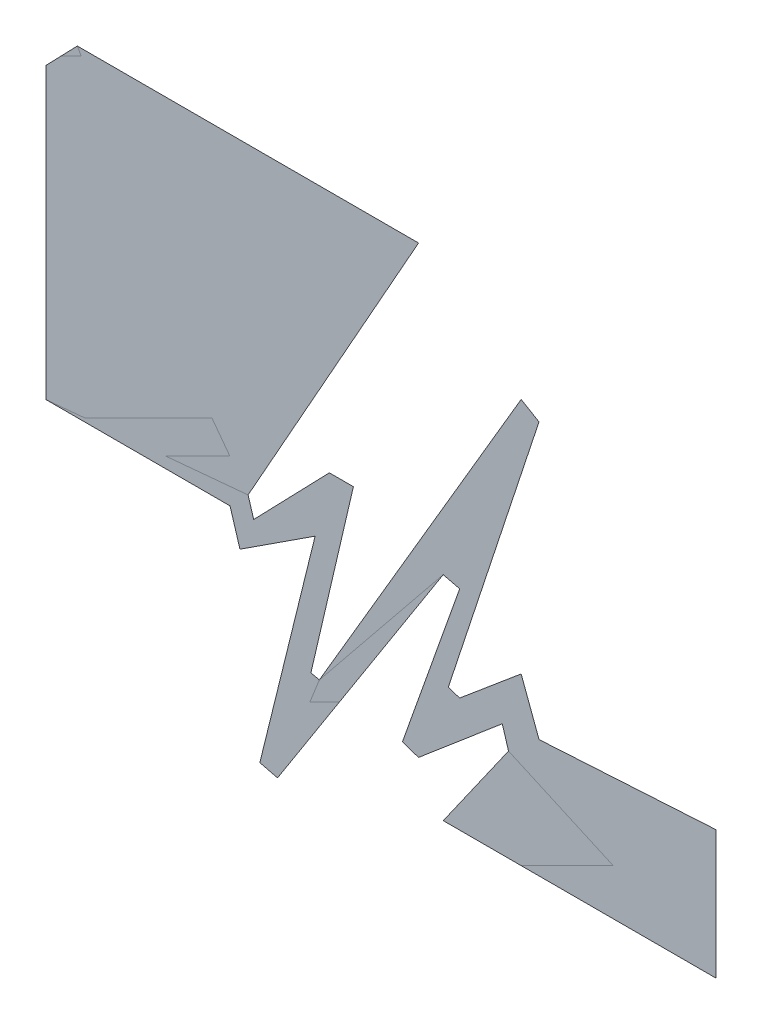
ISO-10303-21;
HEADER;
FILE_DESCRIPTION(('STEP AP214'),'2;1');
FILE_NAME('part.step','',(''),(''),'','','');
FILE_SCHEMA(('AUTOMOTIVE_DESIGN { 1 0 10303 214 1 1 1 1 }'));
ENDSEC;
DATA;
#1=APPLICATION_CONTEXT('core data for automotive mechanical design processes');
#2=APPLICATION_PROTOCOL_DEFINITION('international standard','automotive_design',2000,#1);
#3=PRODUCT_CONTEXT('',#1,'mechanical');
#4=PRODUCT('Part','Part','',(#3));
#5=PRODUCT_RELATED_PRODUCT_CATEGORY('part','',(#4));
#6=PRODUCT_DEFINITION_FORMATION('','',#4);
#7=PRODUCT_DEFINITION_CONTEXT('part definition',#1,'design');
#8=PRODUCT_DEFINITION('design','',#6,#7);
#9=PRODUCT_DEFINITION_SHAPE('','',#8);
#10=(LENGTH_UNIT() NAMED_UNIT(*) SI_UNIT(.MILLI.,.METRE.));
#11=(NAMED_UNIT(*) PLANE_ANGLE_UNIT() SI_UNIT($,.RADIAN.));
#12=(NAMED_UNIT(*) SI_UNIT($,.STERADIAN.) SOLID_ANGLE_UNIT());
#13=UNCERTAINTY_MEASURE_WITH_UNIT(LENGTH_MEASURE(1.E-05),#10,'distance_accuracy_value','');
#14=(GEOMETRIC_REPRESENTATION_CONTEXT(3) GLOBAL_UNCERTAINTY_ASSIGNED_CONTEXT((#13)) GLOBAL_UNIT_ASSIGNED_CONTEXT((#10,
#11,#12)) REPRESENTATION_CONTEXT('',''));
#15=CARTESIAN_POINT('',(0.,0.,0.));
#16=DIRECTION('',(0.,0.,1.));
#17=DIRECTION('',(1.,0.,0.));
#18=AXIS2_PLACEMENT_3D('',#15,#16,#17);
#19=CARTESIAN_POINT('',(5.67705033471,0.853286179995,0.001668));
#20=DIRECTION('',(0.,0.,1.));
#21=DIRECTION('',(1.,0.,0.));
#22=AXIS2_PLACEMENT_3D('',#19,#20,#21);
#23=PLANE('',#22);
#24=CARTESIAN_POINT('',(5.615034054317,0.836498869899,0.001668));
#25=DIRECTION('',(-0.290930916078401,0.956744062991656,0.));
#26=VECTOR('',#25,1.);
#27=LINE('',#24,#26);
#28=CARTESIAN_POINT('',(5.615034054317,0.836498869899,0.0015));
#29=VERTEX_POINT('',#28);
#30=CARTESIAN_POINT('',(5.612052020967,0.846305468461,0.0015));
#31=VERTEX_POINT('',#30);
#32=EDGE_CURVE('E380',#29,#31,#27,.T.);
#33=ORIENTED_EDGE('',*,*,#32,.T.);
#34=CARTESIAN_POINT('',(5.612052020967,0.846305468461,0.001668));
#35=DIRECTION('',(0.489822399636759,0.871822239228897,0.));
#36=VECTOR('',#35,1.);
#37=LINE('',#34,#36);
#38=CARTESIAN_POINT('',(5.702564550781,1.00740638275,0.0015));
#39=VERTEX_POINT('',#38);
#40=EDGE_CURVE('E28',#31,#39,#37,.T.);
#41=ORIENTED_EDGE('',*,*,#40,.T.);
#42=CARTESIAN_POINT('',(5.702564550781,1.00740638275,0.001668));
#43=DIRECTION('',(-1.,0.,0.));
#44=VECTOR('',#43,1.);
#45=LINE('',#42,#44);
#46=CARTESIAN_POINT('',(5.52140258316,1.00740638275,0.0015));
#47=VERTEX_POINT('',#46);
#48=EDGE_CURVE('E11',#39,#47,#45,.T.);
#49=ORIENTED_EDGE('',*,*,#48,.T.);
#50=CARTESIAN_POINT('',(5.52140258316,1.00740638275,0.001668));
#51=DIRECTION('',(-0.695022104774352,-0.718988368386464,0.));
#52=VECTOR('',#51,1.);
#53=LINE('',#50,#52);
#54=CARTESIAN_POINT('',(5.50488152322,0.990315631465,0.0015));
#55=VERTEX_POINT('',#54);
#56=EDGE_CURVE('E122',#47,#55,#53,.T.);
#57=ORIENTED_EDGE('',*,*,#56,.T.);
#58=CARTESIAN_POINT('',(5.50488152322,0.990315631465,0.001668));
#59=DIRECTION('',(0.,-1.,0.));
#60=VECTOR('',#59,1.);
#61=LINE('',#58,#60);
#62=CARTESIAN_POINT('',(5.50488152322,0.836476042626,0.0015));
#63=VERTEX_POINT('',#62);
#64=EDGE_CURVE('E119',#55,#63,#61,.T.);
#65=ORIENTED_EDGE('',*,*,#64,.T.);
#66=CARTESIAN_POINT('',(5.50488152322,0.836476042626,0.001668));
#67=DIRECTION('',(1.,0.,0.));
#68=VECTOR('',#67,1.);
#69=LINE('',#66,#68);
#70=CARTESIAN_POINT('',(5.602478863626,0.836476042626,0.0015));
#71=VERTEX_POINT('',#70);
#72=EDGE_CURVE('E332',#63,#71,#69,.T.);
#73=ORIENTED_EDGE('',*,*,#72,.T.);
#74=CARTESIAN_POINT('',(5.602478863626,0.836476042626,0.001668));
#75=DIRECTION('',(0.290930916059255,-0.956744062997478,0.));
#76=VECTOR('',#75,1.);
#77=LINE('',#74,#76);
#78=CARTESIAN_POINT('',(5.607736954309,0.819184490694,0.0015));
#79=VERTEX_POINT('',#78);
#80=EDGE_CURVE('E333',#71,#79,#77,.T.);
#81=ORIENTED_EDGE('',*,*,#80,.T.);
#82=CARTESIAN_POINT('',(5.607736954309,0.819184490694,0.001668));
#83=DIRECTION('',(0.838198711165695,0.545364942584475,0.));
#84=VECTOR('',#83,1.);
#85=LINE('',#82,#84);
#86=CARTESIAN_POINT('',(5.647645273507,0.845150407747,0.0015));
#87=VERTEX_POINT('',#86);
#88=EDGE_CURVE('E334',#79,#87,#85,.T.);
#89=ORIENTED_EDGE('',*,*,#88,.T.);
#90=CARTESIAN_POINT('',(5.647645273507,0.845150407747,0.001668));
#91=DIRECTION('',(-0.239796451069602,-0.970823187843401,0.));
#92=VECTOR('',#91,1.);
#93=LINE('',#90,#92);
#94=CARTESIAN_POINT('',(5.618296386099,0.726330549046,0.0015));
#95=VERTEX_POINT('',#94);
#96=EDGE_CURVE('E336',#87,#95,#93,.T.);
#97=ORIENTED_EDGE('',*,*,#96,.T.);
#98=CARTESIAN_POINT('',(5.618296386099,0.726330549046,0.001668));
#99=DIRECTION('',(0.970823187839331,-0.239796451086082,0.));
#100=VECTOR('',#99,1.);
#101=LINE('',#98,#100);
#102=CARTESIAN_POINT('',(5.627691113908,0.724010021049,0.0015));
#103=VERTEX_POINT('',#102);
#104=EDGE_CURVE('E338',#95,#103,#101,.T.);
#105=ORIENTED_EDGE('',*,*,#104,.T.);
#106=CARTESIAN_POINT('',(5.627691113908,0.724010021049,0.001668));
#107=DIRECTION('',(0.539142597155286,0.842214497579241,0.));
#108=VECTOR('',#107,1.);
#109=LINE('',#106,#108);
#110=CARTESIAN_POINT('',(5.715674286682,0.861451774018,0.0015));
#111=VERTEX_POINT('',#110);
#112=EDGE_CURVE('E340',#103,#111,#109,.T.);
#113=ORIENTED_EDGE('',*,*,#112,.T.);
#114=CARTESIAN_POINT('',(5.715674286682,0.861451774018,0.001668));
#115=DIRECTION('',(0.970823187840077,-0.239796451083061,0.));
#116=VECTOR('',#115,1.);
#117=LINE('',#114,#116);
#118=CARTESIAN_POINT('',(5.724388688483,0.859299288734,0.0015));
#119=VERTEX_POINT('',#118);
#120=EDGE_CURVE('E342',#111,#119,#117,.T.);
#121=ORIENTED_EDGE('',*,*,#120,.T.);
#122=CARTESIAN_POINT('',(5.724388688483,0.859299288734,0.001668));
#123=DIRECTION('',(-0.334719100787859,-0.942317952480885,0.));
#124=VECTOR('',#123,1.);
#125=LINE('',#122,#124);
#126=CARTESIAN_POINT('',(5.69403629714,0.773849718644,0.0015));
#127=VERTEX_POINT('',#126);
#128=EDGE_CURVE('E344',#119,#127,#125,.T.);
#129=ORIENTED_EDGE('',*,*,#128,.T.);
#130=CARTESIAN_POINT('',(5.69403629714,0.773849718644,0.001668));
#131=DIRECTION('',(0.942317952505512,-0.334719100718526,0.));
#132=VECTOR('',#131,1.);
#133=LINE('',#130,#132);
#134=CARTESIAN_POINT('',(5.702536575865,0.770830349605,0.0015));
#135=VERTEX_POINT('',#134);
#136=EDGE_CURVE('E346',#127,#135,#133,.T.);
#137=ORIENTED_EDGE('',*,*,#136,.T.);
#138=CARTESIAN_POINT('',(5.702536575865,0.770830349605,0.001668));
#139=DIRECTION('',(0.762630156360435,0.646834789269762,0.));
#140=VECTOR('',#139,1.);
#141=LINE('',#138,#140);
#142=CARTESIAN_POINT('',(5.747028371056,0.808566650388,0.0015));
#143=VERTEX_POINT('',#142);
#144=EDGE_CURVE('E348',#135,#143,#141,.T.);
#145=ORIENTED_EDGE('',*,*,#144,.T.);
#146=CARTESIAN_POINT('',(5.747028371056,0.808566650388,0.001668));
#147=DIRECTION('',(0.290930916064505,-0.956744062995882,0.));
#148=VECTOR('',#147,1.);
#149=LINE('',#146,#148);
#150=CARTESIAN_POINT('',(5.750336696642,0.797687019905,0.0015));
#151=VERTEX_POINT('',#150);
#152=EDGE_CURVE('E350',#143,#151,#149,.T.);
#153=ORIENTED_EDGE('',*,*,#152,.T.);
#154=CARTESIAN_POINT('',(5.750336696642,0.797687019905,0.001668));
#155=DIRECTION('',(-0.574791348396888,-0.818300009659102,0.));
#156=VECTOR('',#155,1.);
#157=LINE('',#154,#156);
#158=CARTESIAN_POINT('',(5.715674286682,0.74833998209,0.0015));
#159=VERTEX_POINT('',#158);
#160=EDGE_CURVE('E352',#151,#159,#157,.T.);
#161=ORIENTED_EDGE('',*,*,#160,.T.);
#162=CARTESIAN_POINT('',(5.715674286682,0.74833998209,0.001668));
#163=DIRECTION('',(1.,0.,0.));
#164=VECTOR('',#163,1.);
#165=LINE('',#162,#164);
#166=CARTESIAN_POINT('',(5.860369157796,0.74833998209,0.0015));
#167=VERTEX_POINT('',#166);
#168=EDGE_CURVE('E354',#159,#167,#165,.T.);
#169=ORIENTED_EDGE('',*,*,#168,.T.);
#170=CARTESIAN_POINT('',(5.860369157796,0.74833998209,0.001668));
#171=DIRECTION('',(0.,1.,0.));
#172=VECTOR('',#171,1.);
#173=LINE('',#170,#172);
#174=CARTESIAN_POINT('',(5.860369157796,0.816597330962,0.0015));
#175=VERTEX_POINT('',#174);
#176=EDGE_CURVE('E356',#167,#175,#173,.T.);
#177=ORIENTED_EDGE('',*,*,#176,.T.);
#178=CARTESIAN_POINT('',(5.860369157796,0.816597330962,0.001668));
#179=DIRECTION('',(-0.998267385092081,-0.05884069902218,0.));
#180=VECTOR('',#179,1.);
#181=LINE('',#178,#180);
#182=CARTESIAN_POINT('',(5.766520391411,0.81106561962,0.0015));
#183=VERTEX_POINT('',#182);
#184=EDGE_CURVE('E358',#175,#183,#181,.T.);
#185=ORIENTED_EDGE('',*,*,#184,.T.);
#186=CARTESIAN_POINT('',(5.766520391411,0.81106561962,0.001668));
#187=DIRECTION('',(-0.349274513711859,0.937020444852376,0.));
#188=VECTOR('',#187,1.);
#189=LINE('',#186,#188);
#190=CARTESIAN_POINT('',(5.757040143491,0.836498869899,0.0015));
#191=VERTEX_POINT('',#190);
#192=EDGE_CURVE('E360',#183,#191,#189,.T.);
#193=ORIENTED_EDGE('',*,*,#192,.T.);
#194=CARTESIAN_POINT('',(5.757040143491,0.836498869899,0.001668));
#195=DIRECTION('',(-0.76576721136046,-0.64311785701007,0.));
#196=VECTOR('',#195,1.);
#197=LINE('',#194,#196);
#198=CARTESIAN_POINT('',(5.724388688483,0.809077045797,0.0015));
#199=VERTEX_POINT('',#198);
#200=EDGE_CURVE('E362',#191,#199,#197,.T.);
#201=ORIENTED_EDGE('',*,*,#200,.T.);
#202=CARTESIAN_POINT('',(5.724388688483,0.809077045797,0.001668));
#203=DIRECTION('',(-0.949709432328175,0.313132550442932,0.));
#204=VECTOR('',#203,1.);
#205=LINE('',#202,#204);
#206=CARTESIAN_POINT('',(5.718357481207,0.81106561962,0.0015));
#207=VERTEX_POINT('',#206);
#208=EDGE_CURVE('E364',#199,#207,#205,.T.);
#209=ORIENTED_EDGE('',*,*,#208,.T.);
#210=CARTESIAN_POINT('',(5.718357481207,0.81106561962,0.001668));
#211=DIRECTION('',(0.313132550496098,0.949709432310645,0.));
#212=VECTOR('',#211,1.);
#213=LINE('',#210,#212);
#214=CARTESIAN_POINT('',(5.766520391411,0.957140404997,0.0015));
#215=VERTEX_POINT('',#214);
#216=EDGE_CURVE('E366',#207,#215,#213,.T.);
#217=ORIENTED_EDGE('',*,*,#216,.T.);
#218=CARTESIAN_POINT('',(5.766520391411,0.957140404997,0.001668));
#219=DIRECTION('',(-0.862391365184514,0.506242168586527,0.));
#220=VECTOR('',#219,1.);
#221=LINE('',#218,#220);
#222=CARTESIAN_POINT('',(5.757040143491,0.962705513206,0.0015));
#223=VERTEX_POINT('',#222);
#224=EDGE_CURVE('E368',#215,#223,#221,.T.);
#225=ORIENTED_EDGE('',*,*,#224,.T.);
#226=CARTESIAN_POINT('',(5.757040143491,0.962705513206,0.001668));
#227=DIRECTION('',(-0.506242168647818,-0.862391365148535,0.));
#228=VECTOR('',#227,1.);
#229=LINE('',#226,#228);
#230=CARTESIAN_POINT('',(5.649881356883,0.780158862623,0.0015));
#231=VERTEX_POINT('',#230);
#232=EDGE_CURVE('E370',#223,#231,#229,.T.);
#233=ORIENTED_EDGE('',*,*,#232,.T.);
#234=CARTESIAN_POINT('',(5.649881356883,0.780158862623,0.001668));
#235=DIRECTION('',(-0.97393336584243,0.22683429832994,0.));
#236=VECTOR('',#235,1.);
#237=LINE('',#234,#236);
#238=CARTESIAN_POINT('',(5.645409190132,0.781200454217,0.0015));
#239=VERTEX_POINT('',#238);
#240=EDGE_CURVE('E372',#231,#239,#237,.T.);
#241=ORIENTED_EDGE('',*,*,#240,.T.);
#242=CARTESIAN_POINT('',(5.645409190132,0.781200454217,0.001668));
#243=DIRECTION('',(0.226834298315941,0.97393336584569,0.));
#244=VECTOR('',#243,1.);
#245=LINE('',#242,#244);
#246=CARTESIAN_POINT('',(5.667968223758,0.878059684557,0.0015));
#247=VERTEX_POINT('',#246);
#248=EDGE_CURVE('E374',#239,#247,#245,.T.);
#249=ORIENTED_EDGE('',*,*,#248,.T.);
#250=CARTESIAN_POINT('',(5.667968223758,0.878059684557,0.001668));
#251=DIRECTION('',(-1.,0.,0.));
#252=VECTOR('',#251,1.);
#253=LINE('',#250,#252);
#254=CARTESIAN_POINT('',(5.655209509372,0.878059684557,0.0015));
#255=VERTEX_POINT('',#254);
#256=EDGE_CURVE('E376',#247,#255,#253,.T.);
#257=ORIENTED_EDGE('',*,*,#256,.T.);
#258=CARTESIAN_POINT('',(5.655209509372,0.878059684557,0.001668));
#259=DIRECTION('',(-0.695022104767362,-0.71898836839322,0.));
#260=VECTOR('',#259,1.);
#261=LINE('',#258,#260);
#262=EDGE_CURVE('E378',#255,#29,#261,.T.);
#263=ORIENTED_EDGE('',*,*,#262,.T.);
#264=EDGE_LOOP('',(#33,#41,#49,#57,#65,#73,#81,#89,#97,#105,#113,#121,#129,#137,#145,#153,#161,
#169,#177,#185,#193,#201,#209,#217,#225,#233,#241,#249,#257,#263));
#265=FACE_BOUND('',#264,.T.);
#266=ADVANCED_FACE('F17',(#265),#23,.T.);
#267=CARTESIAN_POINT('',(5.67705033471,0.853286179995,0.001332));
#268=DIRECTION('',(0.,0.,1.));
#269=DIRECTION('',(1.,0.,0.));
#270=AXIS2_PLACEMENT_3D('',#267,#268,#269);
#271=PLANE('',#270);
#272=ORIENTED_EDGE('',*,*,#40,.F.);
#273=ORIENTED_EDGE('',*,*,#32,.F.);
#274=ORIENTED_EDGE('',*,*,#262,.F.);
#275=ORIENTED_EDGE('',*,*,#256,.F.);
#276=ORIENTED_EDGE('',*,*,#248,.F.);
#277=ORIENTED_EDGE('',*,*,#240,.F.);
#278=ORIENTED_EDGE('',*,*,#232,.F.);
#279=ORIENTED_EDGE('',*,*,#224,.F.);
#280=ORIENTED_EDGE('',*,*,#216,.F.);
#281=ORIENTED_EDGE('',*,*,#208,.F.);
#282=ORIENTED_EDGE('',*,*,#200,.F.);
#283=ORIENTED_EDGE('',*,*,#192,.F.);
#284=ORIENTED_EDGE('',*,*,#184,.F.);
#285=ORIENTED_EDGE('',*,*,#176,.F.);
#286=ORIENTED_EDGE('',*,*,#168,.F.);
#287=ORIENTED_EDGE('',*,*,#160,.F.);
#288=ORIENTED_EDGE('',*,*,#152,.F.);
#289=ORIENTED_EDGE('',*,*,#144,.F.);
#290=ORIENTED_EDGE('',*,*,#136,.F.);
#291=ORIENTED_EDGE('',*,*,#128,.F.);
#292=ORIENTED_EDGE('',*,*,#120,.F.);
#293=ORIENTED_EDGE('',*,*,#112,.F.);
#294=ORIENTED_EDGE('',*,*,#104,.F.);
#295=ORIENTED_EDGE('',*,*,#96,.F.);
#296=ORIENTED_EDGE('',*,*,#88,.F.);
#297=ORIENTED_EDGE('',*,*,#80,.F.);
#298=ORIENTED_EDGE('',*,*,#72,.F.);
#299=ORIENTED_EDGE('',*,*,#64,.F.);
#300=ORIENTED_EDGE('',*,*,#56,.F.);
#301=ORIENTED_EDGE('',*,*,#48,.F.);
#302=EDGE_LOOP('',(#272,#273,#274,#275,#276,#277,#278,#279,#280,#281,#282,#283,#284,#285,#286,
#287,#288,#289,#290,#291,#292,#293,#294,#295,#296,#297,#298,#299,#300,#301));
#303=FACE_BOUND('',#302,.T.);
#304=ADVANCED_FACE('F124',(#303),#271,.F.);
#305=CLOSED_SHELL('',(#266,#304));
#306=MANIFOLD_SOLID_BREP('B1',#305);
#307=ADVANCED_BREP_SHAPE_REPRESENTATION('',(#18,#306),#14);
#308=SHAPE_DEFINITION_REPRESENTATION(#9,#307);
ENDSEC;
END-ISO-10303-21;
